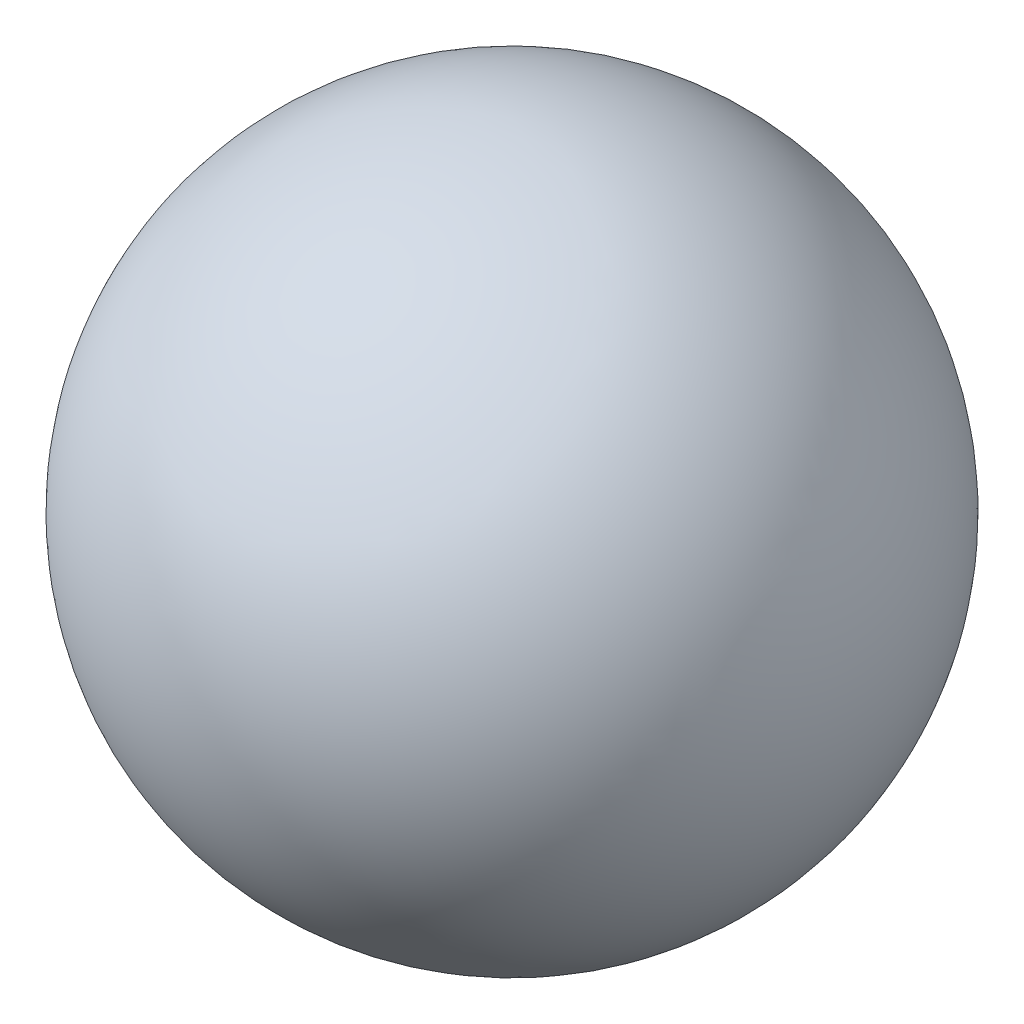
ISO-10303-21;
HEADER;
FILE_DESCRIPTION(('STEP AP214'),'2;1');
FILE_NAME('part.step','',(''),(''),'','','');
FILE_SCHEMA(('AUTOMOTIVE_DESIGN { 1 0 10303 214 1 1 1 1 }'));
ENDSEC;
DATA;
#1=APPLICATION_CONTEXT('core data for automotive mechanical design processes');
#2=APPLICATION_PROTOCOL_DEFINITION('international standard','automotive_design',2000,#1);
#3=PRODUCT_CONTEXT('',#1,'mechanical');
#4=PRODUCT('Part','Part','',(#3));
#5=PRODUCT_RELATED_PRODUCT_CATEGORY('part','',(#4));
#6=PRODUCT_DEFINITION_FORMATION('','',#4);
#7=PRODUCT_DEFINITION_CONTEXT('part definition',#1,'design');
#8=PRODUCT_DEFINITION('design','',#6,#7);
#9=PRODUCT_DEFINITION_SHAPE('','',#8);
#10=(LENGTH_UNIT() NAMED_UNIT(*) SI_UNIT(.MILLI.,.METRE.));
#11=(NAMED_UNIT(*) PLANE_ANGLE_UNIT() SI_UNIT($,.RADIAN.));
#12=(NAMED_UNIT(*) SI_UNIT($,.STERADIAN.) SOLID_ANGLE_UNIT());
#13=UNCERTAINTY_MEASURE_WITH_UNIT(LENGTH_MEASURE(1.E-05),#10,'distance_accuracy_value','');
#14=(GEOMETRIC_REPRESENTATION_CONTEXT(3) GLOBAL_UNCERTAINTY_ASSIGNED_CONTEXT((#13)) GLOBAL_UNIT_ASSIGNED_CONTEXT((#10,
#11,#12)) REPRESENTATION_CONTEXT('',''));
#15=CARTESIAN_POINT('',(0.,0.,0.));
#16=DIRECTION('',(0.,0.,1.));
#17=DIRECTION('',(1.,0.,0.));
#18=AXIS2_PLACEMENT_3D('',#15,#16,#17);
#19=CARTESIAN_POINT('',(0.,0.,0.));
#20=DIRECTION('',(-1.,0.,0.));
#21=DIRECTION('',(0.,0.,-1.));
#22=AXIS2_PLACEMENT_3D('',#19,#20,#21);
#23=SPHERICAL_SURFACE('',#22,19.939);
#24=CARTESIAN_POINT('',(-19.939,0.,0.));
#25=VERTEX_POINT('',#24);
#26=VERTEX_LOOP('',#25);
#27=FACE_BOUND('',#26,.T.);
#28=ADVANCED_FACE('F29',(#27),#23,.T.);
#29=CLOSED_SHELL('',(#28));
#30=MANIFOLD_SOLID_BREP('B2',#29);
#31=ADVANCED_BREP_SHAPE_REPRESENTATION('',(#18,#30),#14);
#32=SHAPE_DEFINITION_REPRESENTATION(#9,#31);
ENDSEC;
END-ISO-10303-21;
